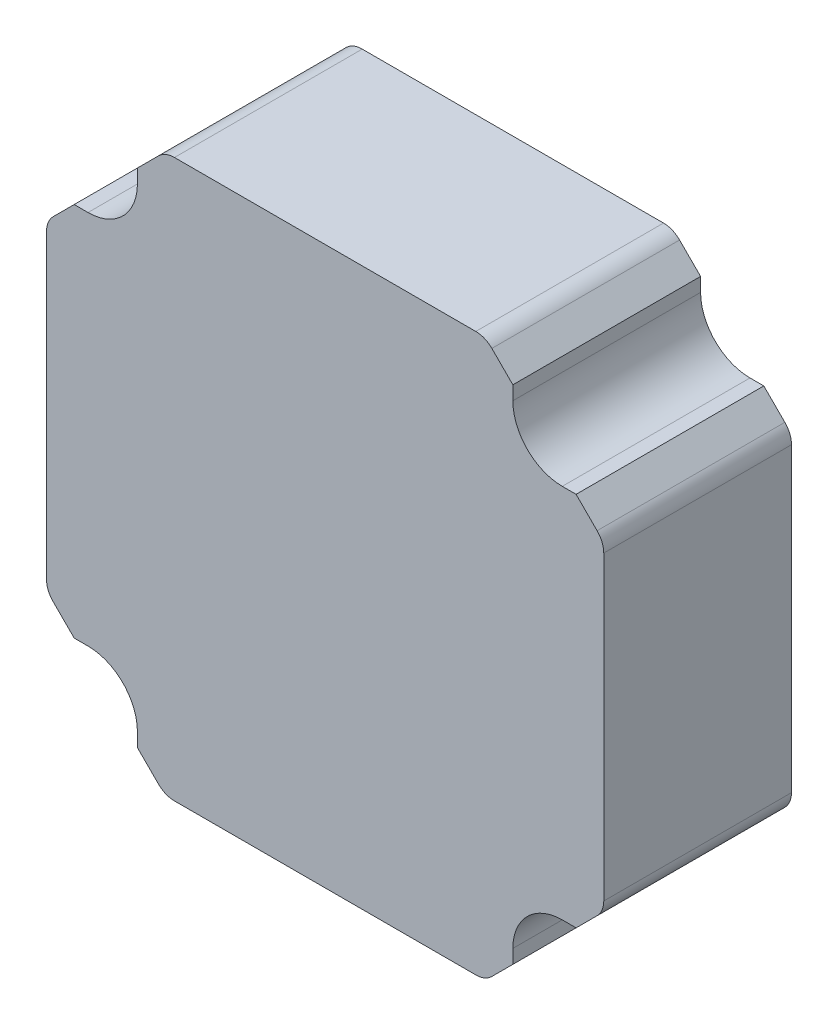
ISO-10303-21;
HEADER;
FILE_DESCRIPTION(('STEP AP214'),'2;1');
FILE_NAME('part.step','',(''),(''),'','','');
FILE_SCHEMA(('AUTOMOTIVE_DESIGN { 1 0 10303 214 1 1 1 1 }'));
ENDSEC;
DATA;
#1=APPLICATION_CONTEXT('core data for automotive mechanical design processes');
#2=APPLICATION_PROTOCOL_DEFINITION('international standard','automotive_design',2000,#1);
#3=PRODUCT_CONTEXT('',#1,'mechanical');
#4=PRODUCT('Part','Part','',(#3));
#5=PRODUCT_RELATED_PRODUCT_CATEGORY('part','',(#4));
#6=PRODUCT_DEFINITION_FORMATION('','',#4);
#7=PRODUCT_DEFINITION_CONTEXT('part definition',#1,'design');
#8=PRODUCT_DEFINITION('design','',#6,#7);
#9=PRODUCT_DEFINITION_SHAPE('','',#8);
#10=(LENGTH_UNIT() NAMED_UNIT(*) SI_UNIT(.MILLI.,.METRE.));
#11=(NAMED_UNIT(*) PLANE_ANGLE_UNIT() SI_UNIT($,.RADIAN.));
#12=(NAMED_UNIT(*) SI_UNIT($,.STERADIAN.) SOLID_ANGLE_UNIT());
#13=UNCERTAINTY_MEASURE_WITH_UNIT(LENGTH_MEASURE(1.E-05),#10,'distance_accuracy_value','');
#14=(GEOMETRIC_REPRESENTATION_CONTEXT(3) GLOBAL_UNCERTAINTY_ASSIGNED_CONTEXT((#13)) GLOBAL_UNIT_ASSIGNED_CONTEXT((#10,
#11,#12)) REPRESENTATION_CONTEXT('',''));
#15=CARTESIAN_POINT('',(0.,0.,0.));
#16=DIRECTION('',(0.,0.,1.));
#17=DIRECTION('',(1.,0.,0.));
#18=AXIS2_PLACEMENT_3D('',#15,#16,#17);
#19=CARTESIAN_POINT('',(24.,19.,19.));
#20=DIRECTION('',(0.,-1.,0.));
#21=DIRECTION('',(0.,0.,-1.));
#22=AXIS2_PLACEMENT_3D('',#19,#20,#21);
#23=PLANE('',#22);
#24=DIRECTION('',(0.,0.,-1.));
#25=VECTOR('',#24,1.);
#26=CARTESIAN_POINT('',(24.,19.,19.));
#27=LINE('',#26,#25);
#28=CARTESIAN_POINT('',(24.,19.,0.));
#29=VERTEX_POINT('',#28);
#30=CARTESIAN_POINT('',(24.,19.,19.));
#31=VERTEX_POINT('',#30);
#32=EDGE_CURVE('E433',#29,#31,#27,.F.);
#33=ORIENTED_EDGE('',*,*,#32,.T.);
#34=DIRECTION('',(1.,0.,0.));
#35=VECTOR('',#34,1.);
#36=CARTESIAN_POINT('',(0.,19.,19.));
#37=LINE('',#36,#35);
#38=CARTESIAN_POINT('',(25.4000000000001,19.,19.));
#39=VERTEX_POINT('',#38);
#40=EDGE_CURVE('E264',#39,#31,#37,.F.);
#41=ORIENTED_EDGE('',*,*,#40,.F.);
#42=DIRECTION('',(0.,0.,1.));
#43=VECTOR('',#42,1.);
#44=CARTESIAN_POINT('',(25.4000000000001,19.,19.));
#45=LINE('',#44,#43);
#46=CARTESIAN_POINT('',(25.4000000000001,19.,0.));
#47=VERTEX_POINT('',#46);
#48=EDGE_CURVE('E224',#39,#47,#45,.F.);
#49=ORIENTED_EDGE('',*,*,#48,.T.);
#50=DIRECTION('',(1.,0.,0.));
#51=VECTOR('',#50,1.);
#52=CARTESIAN_POINT('',(24.,19.,0.));
#53=LINE('',#52,#51);
#54=EDGE_CURVE('E355',#29,#47,#53,.T.);
#55=ORIENTED_EDGE('',*,*,#54,.F.);
#56=EDGE_LOOP('',(#33,#41,#49,#55));
#57=FACE_BOUND('',#56,.T.);
#58=ADVANCED_FACE('F17',(#57),#23,.F.);
#59=CARTESIAN_POINT('',(19.,25.4,19.));
#60=DIRECTION('',(-1.,0.,0.));
#61=DIRECTION('',(0.,0.,1.));
#62=AXIS2_PLACEMENT_3D('',#59,#60,#61);
#63=PLANE('',#62);
#64=DIRECTION('',(0.,0.,1.));
#65=VECTOR('',#64,1.);
#66=CARTESIAN_POINT('',(19.,25.4,19.));
#67=LINE('',#66,#65);
#68=CARTESIAN_POINT('',(19.,25.4,0.));
#69=VERTEX_POINT('',#68);
#70=CARTESIAN_POINT('',(19.,25.4,19.));
#71=VERTEX_POINT('',#70);
#72=EDGE_CURVE('E351',#69,#71,#67,.T.);
#73=ORIENTED_EDGE('',*,*,#72,.T.);
#74=DIRECTION('',(0.,1.,0.));
#75=VECTOR('',#74,1.);
#76=CARTESIAN_POINT('',(19.,0.,19.));
#77=LINE('',#76,#75);
#78=CARTESIAN_POINT('',(19.,24.,19.));
#79=VERTEX_POINT('',#78);
#80=EDGE_CURVE('E259',#79,#71,#77,.T.);
#81=ORIENTED_EDGE('',*,*,#80,.F.);
#82=DIRECTION('',(0.,0.,-1.));
#83=VECTOR('',#82,1.);
#84=CARTESIAN_POINT('',(19.,24.,19.));
#85=LINE('',#84,#83);
#86=CARTESIAN_POINT('',(19.,24.,0.));
#87=VERTEX_POINT('',#86);
#88=EDGE_CURVE('E432',#79,#87,#85,.T.);
#89=ORIENTED_EDGE('',*,*,#88,.T.);
#90=DIRECTION('',(0.,1.,0.));
#91=VECTOR('',#90,1.);
#92=CARTESIAN_POINT('',(19.,25.4,0.));
#93=LINE('',#92,#91);
#94=EDGE_CURVE('E333',#69,#87,#93,.F.);
#95=ORIENTED_EDGE('',*,*,#94,.F.);
#96=EDGE_LOOP('',(#73,#81,#89,#95));
#97=FACE_BOUND('',#96,.T.);
#98=ADVANCED_FACE('F517',(#97),#63,.F.);
#99=CARTESIAN_POINT('',(-19.,24.,19.));
#100=DIRECTION('',(1.,0.,0.));
#101=DIRECTION('',(0.,0.,-1.));
#102=AXIS2_PLACEMENT_3D('',#99,#100,#101);
#103=PLANE('',#102);
#104=DIRECTION('',(0.,0.,-1.));
#105=VECTOR('',#104,1.);
#106=CARTESIAN_POINT('',(-19.,24.,19.));
#107=LINE('',#106,#105);
#108=CARTESIAN_POINT('',(-19.,24.,0.));
#109=VERTEX_POINT('',#108);
#110=CARTESIAN_POINT('',(-19.,24.,19.));
#111=VERTEX_POINT('',#110);
#112=EDGE_CURVE('E427',#109,#111,#107,.F.);
#113=ORIENTED_EDGE('',*,*,#112,.T.);
#114=DIRECTION('',(0.,1.,0.));
#115=VECTOR('',#114,1.);
#116=CARTESIAN_POINT('',(-19.,0.,19.));
#117=LINE('',#116,#115);
#118=CARTESIAN_POINT('',(-19.,25.4000000000001,19.));
#119=VERTEX_POINT('',#118);
#120=EDGE_CURVE('E255',#119,#111,#117,.F.);
#121=ORIENTED_EDGE('',*,*,#120,.F.);
#122=DIRECTION('',(0.,0.,1.));
#123=VECTOR('',#122,1.);
#124=CARTESIAN_POINT('',(-19.,25.4000000000001,19.));
#125=LINE('',#124,#123);
#126=CARTESIAN_POINT('',(-19.,25.4000000000001,0.));
#127=VERTEX_POINT('',#126);
#128=EDGE_CURVE('E339',#119,#127,#125,.F.);
#129=ORIENTED_EDGE('',*,*,#128,.T.);
#130=DIRECTION('',(0.,1.,0.));
#131=VECTOR('',#130,1.);
#132=CARTESIAN_POINT('',(-19.,24.,0.));
#133=LINE('',#132,#131);
#134=EDGE_CURVE('E328',#109,#127,#133,.T.);
#135=ORIENTED_EDGE('',*,*,#134,.F.);
#136=EDGE_LOOP('',(#113,#121,#129,#135));
#137=FACE_BOUND('',#136,.T.);
#138=ADVANCED_FACE('F624',(#137),#103,.F.);
#139=CARTESIAN_POINT('',(-25.4,19.,19.));
#140=DIRECTION('',(0.,-1.,0.));
#141=DIRECTION('',(0.,0.,-1.));
#142=AXIS2_PLACEMENT_3D('',#139,#140,#141);
#143=PLANE('',#142);
#144=DIRECTION('',(0.,0.,1.));
#145=VECTOR('',#144,1.);
#146=CARTESIAN_POINT('',(-25.4,19.,19.));
#147=LINE('',#146,#145);
#148=CARTESIAN_POINT('',(-25.4,19.,0.));
#149=VERTEX_POINT('',#148);
#150=CARTESIAN_POINT('',(-25.4,19.,19.));
#151=VERTEX_POINT('',#150);
#152=EDGE_CURVE('E324',#149,#151,#147,.T.);
#153=ORIENTED_EDGE('',*,*,#152,.T.);
#154=DIRECTION('',(1.,0.,0.));
#155=VECTOR('',#154,1.);
#156=CARTESIAN_POINT('',(0.,19.,19.));
#157=LINE('',#156,#155);
#158=CARTESIAN_POINT('',(-24.,19.,19.));
#159=VERTEX_POINT('',#158);
#160=EDGE_CURVE('E250',#159,#151,#157,.F.);
#161=ORIENTED_EDGE('',*,*,#160,.F.);
#162=DIRECTION('',(0.,0.,-1.));
#163=VECTOR('',#162,1.);
#164=CARTESIAN_POINT('',(-24.,19.,19.));
#165=LINE('',#164,#163);
#166=CARTESIAN_POINT('',(-24.,19.,0.));
#167=VERTEX_POINT('',#166);
#168=EDGE_CURVE('E426',#159,#167,#165,.T.);
#169=ORIENTED_EDGE('',*,*,#168,.T.);
#170=DIRECTION('',(1.,0.,0.));
#171=VECTOR('',#170,1.);
#172=CARTESIAN_POINT('',(-25.4,19.,0.));
#173=LINE('',#172,#171);
#174=EDGE_CURVE('E305',#149,#167,#173,.T.);
#175=ORIENTED_EDGE('',*,*,#174,.F.);
#176=EDGE_LOOP('',(#153,#161,#169,#175));
#177=FACE_BOUND('',#176,.T.);
#178=ADVANCED_FACE('F643',(#177),#143,.F.);
#179=CARTESIAN_POINT('',(-24.,-19.,19.));
#180=DIRECTION('',(0.,1.,0.));
#181=DIRECTION('',(0.,0.,1.));
#182=AXIS2_PLACEMENT_3D('',#179,#180,#181);
#183=PLANE('',#182);
#184=DIRECTION('',(0.,0.,-1.));
#185=VECTOR('',#184,1.);
#186=CARTESIAN_POINT('',(-24.,-19.,19.));
#187=LINE('',#186,#185);
#188=CARTESIAN_POINT('',(-24.,-19.,0.));
#189=VERTEX_POINT('',#188);
#190=CARTESIAN_POINT('',(-24.,-19.,19.));
#191=VERTEX_POINT('',#190);
#192=EDGE_CURVE('E419',#189,#191,#187,.F.);
#193=ORIENTED_EDGE('',*,*,#192,.T.);
#194=DIRECTION('',(1.,0.,0.));
#195=VECTOR('',#194,1.);
#196=CARTESIAN_POINT('',(0.,-19.,19.));
#197=LINE('',#196,#195);
#198=CARTESIAN_POINT('',(-25.4000000000001,-19.,19.));
#199=VERTEX_POINT('',#198);
#200=EDGE_CURVE('E246',#199,#191,#197,.T.);
#201=ORIENTED_EDGE('',*,*,#200,.F.);
#202=DIRECTION('',(0.,0.,1.));
#203=VECTOR('',#202,1.);
#204=CARTESIAN_POINT('',(-25.4000000000001,-19.,19.));
#205=LINE('',#204,#203);
#206=CARTESIAN_POINT('',(-25.4000000000001,-19.,0.));
#207=VERTEX_POINT('',#206);
#208=EDGE_CURVE('E311',#199,#207,#205,.F.);
#209=ORIENTED_EDGE('',*,*,#208,.T.);
#210=DIRECTION('',(1.,0.,0.));
#211=VECTOR('',#210,1.);
#212=CARTESIAN_POINT('',(-24.,-19.,0.));
#213=LINE('',#212,#211);
#214=EDGE_CURVE('E300',#189,#207,#213,.F.);
#215=ORIENTED_EDGE('',*,*,#214,.F.);
#216=EDGE_LOOP('',(#193,#201,#209,#215));
#217=FACE_BOUND('',#216,.T.);
#218=ADVANCED_FACE('F670',(#217),#183,.F.);
#219=CARTESIAN_POINT('',(-19.,-25.4,19.));
#220=DIRECTION('',(1.,0.,0.));
#221=DIRECTION('',(0.,0.,-1.));
#222=AXIS2_PLACEMENT_3D('',#219,#220,#221);
#223=PLANE('',#222);
#224=DIRECTION('',(0.,0.,1.));
#225=VECTOR('',#224,1.);
#226=CARTESIAN_POINT('',(-19.,-25.4,19.));
#227=LINE('',#226,#225);
#228=CARTESIAN_POINT('',(-19.,-25.4,0.));
#229=VERTEX_POINT('',#228);
#230=CARTESIAN_POINT('',(-19.,-25.4,19.));
#231=VERTEX_POINT('',#230);
#232=EDGE_CURVE('E296',#229,#231,#227,.T.);
#233=ORIENTED_EDGE('',*,*,#232,.T.);
#234=DIRECTION('',(0.,1.,0.));
#235=VECTOR('',#234,1.);
#236=CARTESIAN_POINT('',(-19.,0.,19.));
#237=LINE('',#236,#235);
#238=CARTESIAN_POINT('',(-19.,-24.,19.));
#239=VERTEX_POINT('',#238);
#240=EDGE_CURVE('E241',#239,#231,#237,.F.);
#241=ORIENTED_EDGE('',*,*,#240,.F.);
#242=DIRECTION('',(0.,0.,-1.));
#243=VECTOR('',#242,1.);
#244=CARTESIAN_POINT('',(-19.,-24.,19.));
#245=LINE('',#244,#243);
#246=CARTESIAN_POINT('',(-19.,-24.,0.));
#247=VERTEX_POINT('',#246);
#248=EDGE_CURVE('E418',#239,#247,#245,.T.);
#249=ORIENTED_EDGE('',*,*,#248,.T.);
#250=DIRECTION('',(0.,1.,0.));
#251=VECTOR('',#250,1.);
#252=CARTESIAN_POINT('',(-19.,-25.4,0.));
#253=LINE('',#252,#251);
#254=EDGE_CURVE('E277',#229,#247,#253,.T.);
#255=ORIENTED_EDGE('',*,*,#254,.F.);
#256=EDGE_LOOP('',(#233,#241,#249,#255));
#257=FACE_BOUND('',#256,.T.);
#258=ADVANCED_FACE('F605',(#257),#223,.F.);
#259=CARTESIAN_POINT('',(19.,-24.,19.));
#260=DIRECTION('',(-1.,0.,0.));
#261=DIRECTION('',(0.,0.,1.));
#262=AXIS2_PLACEMENT_3D('',#259,#260,#261);
#263=PLANE('',#262);
#264=DIRECTION('',(0.,0.,-1.));
#265=VECTOR('',#264,1.);
#266=CARTESIAN_POINT('',(19.,-24.,19.));
#267=LINE('',#266,#265);
#268=CARTESIAN_POINT('',(19.,-24.,0.));
#269=VERTEX_POINT('',#268);
#270=CARTESIAN_POINT('',(19.,-24.,19.));
#271=VERTEX_POINT('',#270);
#272=EDGE_CURVE('E411',#269,#271,#267,.F.);
#273=ORIENTED_EDGE('',*,*,#272,.T.);
#274=DIRECTION('',(0.,1.,0.));
#275=VECTOR('',#274,1.);
#276=CARTESIAN_POINT('',(19.,0.,19.));
#277=LINE('',#276,#275);
#278=CARTESIAN_POINT('',(19.,-25.4000000000001,19.));
#279=VERTEX_POINT('',#278);
#280=EDGE_CURVE('E237',#279,#271,#277,.T.);
#281=ORIENTED_EDGE('',*,*,#280,.F.);
#282=DIRECTION('',(0.,0.,1.));
#283=VECTOR('',#282,1.);
#284=CARTESIAN_POINT('',(19.,-25.4000000000001,19.));
#285=LINE('',#284,#283);
#286=CARTESIAN_POINT('',(19.,-25.4000000000001,0.));
#287=VERTEX_POINT('',#286);
#288=EDGE_CURVE('E283',#279,#287,#285,.F.);
#289=ORIENTED_EDGE('',*,*,#288,.T.);
#290=DIRECTION('',(0.,1.,0.));
#291=VECTOR('',#290,1.);
#292=CARTESIAN_POINT('',(19.,-24.,0.));
#293=LINE('',#292,#291);
#294=EDGE_CURVE('E272',#269,#287,#293,.F.);
#295=ORIENTED_EDGE('',*,*,#294,.F.);
#296=EDGE_LOOP('',(#273,#281,#289,#295));
#297=FACE_BOUND('',#296,.T.);
#298=ADVANCED_FACE('F581',(#297),#263,.F.);
#299=CARTESIAN_POINT('',(25.4,-19.,19.));
#300=DIRECTION('',(0.,1.,0.));
#301=DIRECTION('',(0.,0.,1.));
#302=AXIS2_PLACEMENT_3D('',#299,#300,#301);
#303=PLANE('',#302);
#304=DIRECTION('',(0.,0.,1.));
#305=VECTOR('',#304,1.);
#306=CARTESIAN_POINT('',(25.4,-19.,19.));
#307=LINE('',#306,#305);
#308=CARTESIAN_POINT('',(25.4,-19.,0.));
#309=VERTEX_POINT('',#308);
#310=CARTESIAN_POINT('',(25.4,-19.,19.));
#311=VERTEX_POINT('',#310);
#312=EDGE_CURVE('E233',#309,#311,#307,.T.);
#313=ORIENTED_EDGE('',*,*,#312,.T.);
#314=DIRECTION('',(1.,0.,0.));
#315=VECTOR('',#314,1.);
#316=CARTESIAN_POINT('',(0.,-19.,19.));
#317=LINE('',#316,#315);
#318=CARTESIAN_POINT('',(24.,-19.,19.));
#319=VERTEX_POINT('',#318);
#320=EDGE_CURVE('E218',#319,#311,#317,.T.);
#321=ORIENTED_EDGE('',*,*,#320,.F.);
#322=DIRECTION('',(0.,0.,-1.));
#323=VECTOR('',#322,1.);
#324=CARTESIAN_POINT('',(24.,-19.,19.));
#325=LINE('',#324,#323);
#326=CARTESIAN_POINT('',(24.,-19.,0.));
#327=VERTEX_POINT('',#326);
#328=EDGE_CURVE('E410',#319,#327,#325,.T.);
#329=ORIENTED_EDGE('',*,*,#328,.T.);
#330=DIRECTION('',(1.,0.,0.));
#331=VECTOR('',#330,1.);
#332=CARTESIAN_POINT('',(25.4,-19.,0.));
#333=LINE('',#332,#331);
#334=EDGE_CURVE('E268',#309,#327,#333,.F.);
#335=ORIENTED_EDGE('',*,*,#334,.F.);
#336=EDGE_LOOP('',(#313,#321,#329,#335));
#337=FACE_BOUND('',#336,.T.);
#338=ADVANCED_FACE('F569',(#337),#303,.F.);
#339=CARTESIAN_POINT('',(0.,0.,19.));
#340=DIRECTION('',(0.,0.,1.));
#341=DIRECTION('',(1.,0.,0.));
#342=AXIS2_PLACEMENT_3D('',#339,#340,#341);
#343=PLANE('',#342);
#344=ORIENTED_EDGE('',*,*,#320,.T.);
#345=DIRECTION('',(-0.707106781186551,-0.707106781186544,0.));
#346=VECTOR('',#345,1.);
#347=CARTESIAN_POINT('',(28.2,-16.2,19.));
#348=LINE('',#347,#346);
#349=CARTESIAN_POINT('',(27.5263455967291,-16.8736544032709,19.));
#350=VERTEX_POINT('',#349);
#351=EDGE_CURVE('E230',#311,#350,#348,.F.);
#352=ORIENTED_EDGE('',*,*,#351,.T.);
#353=CARTESIAN_POINT('',(25.9,-15.2473088065419,19.));
#354=DIRECTION('',(0.,0.,-1.));
#355=DIRECTION('',(-1.,0.,0.));
#356=AXIS2_PLACEMENT_3D('',#353,#354,#355);
#357=CIRCLE('',#356,2.3);
#358=CARTESIAN_POINT('',(28.2,-15.2473088065419,19.));
#359=VERTEX_POINT('',#358);
#360=EDGE_CURVE('E214',#359,#350,#357,.T.);
#361=ORIENTED_EDGE('',*,*,#360,.F.);
#362=DIRECTION('',(0.,1.,0.));
#363=VECTOR('',#362,1.);
#364=CARTESIAN_POINT('',(28.2,28.2,19.));
#365=LINE('',#364,#363);
#366=CARTESIAN_POINT('',(28.2,15.2473088065419,19.));
#367=VERTEX_POINT('',#366);
#368=EDGE_CURVE('E209',#367,#359,#365,.F.);
#369=ORIENTED_EDGE('',*,*,#368,.F.);
#370=CARTESIAN_POINT('',(25.9,15.2473088065419,19.));
#371=DIRECTION('',(0.,0.,1.));
#372=DIRECTION('',(1.,0.,0.));
#373=AXIS2_PLACEMENT_3D('',#370,#371,#372);
#374=CIRCLE('',#373,2.3);
#375=CARTESIAN_POINT('',(27.5263455967291,16.8736544032709,19.));
#376=VERTEX_POINT('',#375);
#377=EDGE_CURVE('E20',#376,#367,#374,.F.);
#378=ORIENTED_EDGE('',*,*,#377,.F.);
#379=DIRECTION('',(0.707106781186544,-0.707106781186551,0.));
#380=VECTOR('',#379,1.);
#381=CARTESIAN_POINT('',(25.4000000000001,19.,19.));
#382=LINE('',#381,#380);
#383=EDGE_CURVE('E194',#376,#39,#382,.F.);
#384=ORIENTED_EDGE('',*,*,#383,.T.);
#385=ORIENTED_EDGE('',*,*,#40,.T.);
#386=CARTESIAN_POINT('',(24.,24.,19.));
#387=DIRECTION('',(0.,0.,-1.));
#388=DIRECTION('',(-1.,0.,0.));
#389=AXIS2_PLACEMENT_3D('',#386,#387,#388);
#390=CIRCLE('',#389,5.);
#391=EDGE_CURVE('E430',#31,#79,#390,.T.);
#392=ORIENTED_EDGE('',*,*,#391,.T.);
#393=ORIENTED_EDGE('',*,*,#80,.T.);
#394=DIRECTION('',(0.707106781186544,-0.707106781186551,0.));
#395=VECTOR('',#394,1.);
#396=CARTESIAN_POINT('',(16.2,28.2,19.));
#397=LINE('',#396,#395);
#398=CARTESIAN_POINT('',(16.8736544032709,27.5263455967291,19.));
#399=VERTEX_POINT('',#398);
#400=EDGE_CURVE('E347',#71,#399,#397,.F.);
#401=ORIENTED_EDGE('',*,*,#400,.T.);
#402=CARTESIAN_POINT('',(15.2473088065419,25.9,19.));
#403=DIRECTION('',(0.,0.,-1.));
#404=DIRECTION('',(-1.,0.,0.));
#405=AXIS2_PLACEMENT_3D('',#402,#403,#404);
#406=CIRCLE('',#405,2.3);
#407=CARTESIAN_POINT('',(15.2473088065419,28.2,19.));
#408=VERTEX_POINT('',#407);
#409=EDGE_CURVE('E350',#408,#399,#406,.T.);
#410=ORIENTED_EDGE('',*,*,#409,.F.);
#411=DIRECTION('',(1.,0.,0.));
#412=VECTOR('',#411,1.);
#413=CARTESIAN_POINT('',(-28.2,28.2,19.));
#414=LINE('',#413,#412);
#415=CARTESIAN_POINT('',(-15.2473088065419,28.2,19.));
#416=VERTEX_POINT('',#415);
#417=EDGE_CURVE('E343',#416,#408,#414,.T.);
#418=ORIENTED_EDGE('',*,*,#417,.F.);
#419=CARTESIAN_POINT('',(-15.2473088065419,25.9,19.));
#420=DIRECTION('',(0.,0.,1.));
#421=DIRECTION('',(1.,0.,0.));
#422=AXIS2_PLACEMENT_3D('',#419,#420,#421);
#423=CIRCLE('',#422,2.3);
#424=CARTESIAN_POINT('',(-16.8736544032709,27.5263455967291,19.));
#425=VERTEX_POINT('',#424);
#426=EDGE_CURVE('E428',#425,#416,#423,.F.);
#427=ORIENTED_EDGE('',*,*,#426,.F.);
#428=DIRECTION('',(0.707106781186551,0.707106781186544,0.));
#429=VECTOR('',#428,1.);
#430=CARTESIAN_POINT('',(-19.,25.4000000000001,19.));
#431=LINE('',#430,#429);
#432=EDGE_CURVE('E336',#425,#119,#431,.F.);
#433=ORIENTED_EDGE('',*,*,#432,.T.);
#434=ORIENTED_EDGE('',*,*,#120,.T.);
#435=CARTESIAN_POINT('',(-24.,24.,19.));
#436=DIRECTION('',(0.,0.,-1.));
#437=DIRECTION('',(-1.,0.,0.));
#438=AXIS2_PLACEMENT_3D('',#435,#436,#437);
#439=CIRCLE('',#438,5.);
#440=EDGE_CURVE('E423',#111,#159,#439,.T.);
#441=ORIENTED_EDGE('',*,*,#440,.T.);
#442=ORIENTED_EDGE('',*,*,#160,.T.);
#443=DIRECTION('',(0.707106781186551,0.707106781186544,0.));
#444=VECTOR('',#443,1.);
#445=CARTESIAN_POINT('',(-28.2,16.2,19.));
#446=LINE('',#445,#444);
#447=CARTESIAN_POINT('',(-27.5263455967291,16.8736544032709,19.));
#448=VERTEX_POINT('',#447);
#449=EDGE_CURVE('E320',#151,#448,#446,.F.);
#450=ORIENTED_EDGE('',*,*,#449,.T.);
#451=CARTESIAN_POINT('',(-25.9,15.2473088065419,19.));
#452=DIRECTION('',(0.,0.,-1.));
#453=DIRECTION('',(-1.,0.,0.));
#454=AXIS2_PLACEMENT_3D('',#451,#452,#453);
#455=CIRCLE('',#454,2.3);
#456=CARTESIAN_POINT('',(-28.2,15.2473088065419,19.));
#457=VERTEX_POINT('',#456);
#458=EDGE_CURVE('E323',#457,#448,#455,.T.);
#459=ORIENTED_EDGE('',*,*,#458,.F.);
#460=DIRECTION('',(0.,1.,0.));
#461=VECTOR('',#460,1.);
#462=CARTESIAN_POINT('',(-28.2,-28.2,19.));
#463=LINE('',#462,#461);
#464=CARTESIAN_POINT('',(-28.2,-15.2473088065419,19.));
#465=VERTEX_POINT('',#464);
#466=EDGE_CURVE('E315',#465,#457,#463,.T.);
#467=ORIENTED_EDGE('',*,*,#466,.F.);
#468=CARTESIAN_POINT('',(-25.9,-15.2473088065419,19.));
#469=DIRECTION('',(0.,0.,1.));
#470=DIRECTION('',(1.,0.,0.));
#471=AXIS2_PLACEMENT_3D('',#468,#469,#470);
#472=CIRCLE('',#471,2.3);
#473=CARTESIAN_POINT('',(-27.5263455967291,-16.8736544032709,19.));
#474=VERTEX_POINT('',#473);
#475=EDGE_CURVE('E318',#474,#465,#472,.F.);
#476=ORIENTED_EDGE('',*,*,#475,.F.);
#477=DIRECTION('',(-0.707106781186544,0.707106781186551,0.));
#478=VECTOR('',#477,1.);
#479=CARTESIAN_POINT('',(-25.4000000000001,-19.,19.));
#480=LINE('',#479,#478);
#481=EDGE_CURVE('E308',#474,#199,#480,.F.);
#482=ORIENTED_EDGE('',*,*,#481,.T.);
#483=ORIENTED_EDGE('',*,*,#200,.T.);
#484=CARTESIAN_POINT('',(-24.,-24.,19.));
#485=DIRECTION('',(0.,0.,-1.));
#486=DIRECTION('',(-1.,0.,0.));
#487=AXIS2_PLACEMENT_3D('',#484,#485,#486);
#488=CIRCLE('',#487,5.);
#489=EDGE_CURVE('E415',#191,#239,#488,.T.);
#490=ORIENTED_EDGE('',*,*,#489,.T.);
#491=ORIENTED_EDGE('',*,*,#240,.T.);
#492=DIRECTION('',(-0.707106781186544,0.707106781186551,0.));
#493=VECTOR('',#492,1.);
#494=CARTESIAN_POINT('',(-16.2,-28.2,19.));
#495=LINE('',#494,#493);
#496=CARTESIAN_POINT('',(-16.8736544032709,-27.5263455967291,19.));
#497=VERTEX_POINT('',#496);
#498=EDGE_CURVE('E292',#231,#497,#495,.F.);
#499=ORIENTED_EDGE('',*,*,#498,.T.);
#500=CARTESIAN_POINT('',(-15.2473088065419,-25.9,19.));
#501=DIRECTION('',(0.,0.,-1.));
#502=DIRECTION('',(-1.,0.,0.));
#503=AXIS2_PLACEMENT_3D('',#500,#501,#502);
#504=CIRCLE('',#503,2.3);
#505=CARTESIAN_POINT('',(-15.2473088065419,-28.2,19.));
#506=VERTEX_POINT('',#505);
#507=EDGE_CURVE('E295',#506,#497,#504,.T.);
#508=ORIENTED_EDGE('',*,*,#507,.F.);
#509=DIRECTION('',(1.,0.,0.));
#510=VECTOR('',#509,1.);
#511=CARTESIAN_POINT('',(28.2,-28.2,19.));
#512=LINE('',#511,#510);
#513=CARTESIAN_POINT('',(15.2473088065419,-28.2,19.));
#514=VERTEX_POINT('',#513);
#515=EDGE_CURVE('E287',#514,#506,#512,.F.);
#516=ORIENTED_EDGE('',*,*,#515,.F.);
#517=CARTESIAN_POINT('',(15.2473088065419,-25.9,19.));
#518=DIRECTION('',(0.,0.,1.));
#519=DIRECTION('',(1.,0.,0.));
#520=AXIS2_PLACEMENT_3D('',#517,#518,#519);
#521=CIRCLE('',#520,2.3);
#522=CARTESIAN_POINT('',(16.8736544032709,-27.5263455967291,19.));
#523=VERTEX_POINT('',#522);
#524=EDGE_CURVE('E290',#523,#514,#521,.F.);
#525=ORIENTED_EDGE('',*,*,#524,.F.);
#526=DIRECTION('',(-0.707106781186551,-0.707106781186544,0.));
#527=VECTOR('',#526,1.);
#528=CARTESIAN_POINT('',(19.,-25.4000000000001,19.));
#529=LINE('',#528,#527);
#530=EDGE_CURVE('E280',#523,#279,#529,.F.);
#531=ORIENTED_EDGE('',*,*,#530,.T.);
#532=ORIENTED_EDGE('',*,*,#280,.T.);
#533=CARTESIAN_POINT('',(24.,-24.,19.));
#534=DIRECTION('',(0.,0.,-1.));
#535=DIRECTION('',(-1.,0.,0.));
#536=AXIS2_PLACEMENT_3D('',#533,#534,#535);
#537=CIRCLE('',#536,5.);
#538=EDGE_CURVE('E407',#271,#319,#537,.T.);
#539=ORIENTED_EDGE('',*,*,#538,.T.);
#540=EDGE_LOOP('',(#344,#352,#361,#369,#378,#384,#385,#392,#393,#401,#410,#418,#427,#433,#434,
#441,#442,#450,#459,#467,#476,#482,#483,#490,#491,#499,#508,#516,#525,#531,#532,#539));
#541=FACE_BOUND('',#540,.T.);
#542=ADVANCED_FACE('F212',(#541),#343,.T.);
#543=CARTESIAN_POINT('',(28.2,28.2,0.));
#544=DIRECTION('',(1.,0.,0.));
#545=DIRECTION('',(0.,0.,-1.));
#546=AXIS2_PLACEMENT_3D('',#543,#544,#545);
#547=PLANE('',#546);
#548=DIRECTION('',(0.,0.,1.));
#549=VECTOR('',#548,1.);
#550=CARTESIAN_POINT('',(28.2,15.2473088065419,9.5));
#551=LINE('',#550,#549);
#552=CARTESIAN_POINT('',(28.2,15.2473088065419,0.));
#553=VERTEX_POINT('',#552);
#554=EDGE_CURVE('E205',#367,#553,#551,.F.);
#555=ORIENTED_EDGE('',*,*,#554,.F.);
#556=ORIENTED_EDGE('',*,*,#368,.T.);
#557=DIRECTION('',(0.,0.,-1.));
#558=VECTOR('',#557,1.);
#559=CARTESIAN_POINT('',(28.2,-15.2473088065419,9.5));
#560=LINE('',#559,#558);
#561=CARTESIAN_POINT('',(28.2,-15.2473088065419,0.));
#562=VERTEX_POINT('',#561);
#563=EDGE_CURVE('E232',#562,#359,#560,.F.);
#564=ORIENTED_EDGE('',*,*,#563,.F.);
#565=DIRECTION('',(0.,1.,0.));
#566=VECTOR('',#565,1.);
#567=CARTESIAN_POINT('',(28.2,0.,0.));
#568=LINE('',#567,#566);
#569=EDGE_CURVE('E222',#562,#553,#568,.T.);
#570=ORIENTED_EDGE('',*,*,#569,.T.);
#571=EDGE_LOOP('',(#555,#556,#564,#570));
#572=FACE_BOUND('',#571,.T.);
#573=ADVANCED_FACE('F221',(#572),#547,.T.);
#574=CARTESIAN_POINT('',(25.9,15.2473088065419,9.5));
#575=DIRECTION('',(0.,0.,1.));
#576=DIRECTION('',(1.,0.,0.));
#577=AXIS2_PLACEMENT_3D('',#574,#575,#576);
#578=CYLINDRICAL_SURFACE('',#577,2.3);
#579=CARTESIAN_POINT('',(25.9,15.2473088065419,0.));
#580=DIRECTION('',(0.,0.,1.));
#581=DIRECTION('',(1.,0.,0.));
#582=AXIS2_PLACEMENT_3D('',#579,#580,#581);
#583=CIRCLE('',#582,2.3);
#584=CARTESIAN_POINT('',(27.5263455967291,16.8736544032709,0.));
#585=VERTEX_POINT('',#584);
#586=EDGE_CURVE('E404',#553,#585,#583,.T.);
#587=ORIENTED_EDGE('',*,*,#586,.T.);
#588=DIRECTION('',(0.,0.,1.));
#589=VECTOR('',#588,1.);
#590=CARTESIAN_POINT('',(27.5263455967291,16.8736544032709,19.));
#591=LINE('',#590,#589);
#592=EDGE_CURVE('E207',#585,#376,#591,.T.);
#593=ORIENTED_EDGE('',*,*,#592,.T.);
#594=ORIENTED_EDGE('',*,*,#377,.T.);
#595=ORIENTED_EDGE('',*,*,#554,.T.);
#596=EDGE_LOOP('',(#587,#593,#594,#595));
#597=FACE_BOUND('',#596,.T.);
#598=ADVANCED_FACE('F203',(#597),#578,.T.);
#599=CARTESIAN_POINT('',(25.4000000000001,19.,19.));
#600=DIRECTION('',(-0.707106781186551,-0.707106781186544,0.));
#601=DIRECTION('',(0.707106781186544,-0.707106781186551,0.));
#602=AXIS2_PLACEMENT_3D('',#599,#600,#601);
#603=PLANE('',#602);
#604=DIRECTION('',(-0.707106781186543,0.707106781186552,0.));
#605=VECTOR('',#604,1.);
#606=CARTESIAN_POINT('',(27.5263455967291,16.8736544032709,0.));
#607=LINE('',#606,#605);
#608=EDGE_CURVE('E403',#585,#47,#607,.T.);
#609=ORIENTED_EDGE('',*,*,#608,.T.);
#610=ORIENTED_EDGE('',*,*,#48,.F.);
#611=ORIENTED_EDGE('',*,*,#383,.F.);
#612=ORIENTED_EDGE('',*,*,#592,.F.);
#613=EDGE_LOOP('',(#609,#610,#611,#612));
#614=FACE_BOUND('',#613,.T.);
#615=ADVANCED_FACE('F446',(#614),#603,.F.);
#616=CARTESIAN_POINT('',(24.,24.,19.));
#617=DIRECTION('',(0.,0.,-1.));
#618=DIRECTION('',(-1.,0.,0.));
#619=AXIS2_PLACEMENT_3D('',#616,#617,#618);
#620=CYLINDRICAL_SURFACE('',#619,5.);
#621=ORIENTED_EDGE('',*,*,#88,.F.);
#622=ORIENTED_EDGE('',*,*,#391,.F.);
#623=ORIENTED_EDGE('',*,*,#32,.F.);
#624=CARTESIAN_POINT('',(24.,24.,0.));
#625=DIRECTION('',(0.,0.,-1.));
#626=DIRECTION('',(-1.,0.,0.));
#627=AXIS2_PLACEMENT_3D('',#624,#625,#626);
#628=CIRCLE('',#627,5.);
#629=EDGE_CURVE('E400',#29,#87,#628,.T.);
#630=ORIENTED_EDGE('',*,*,#629,.T.);
#631=EDGE_LOOP('',(#621,#622,#623,#630));
#632=FACE_BOUND('',#631,.T.);
#633=ADVANCED_FACE('F838',(#632),#620,.F.);
#634=CARTESIAN_POINT('',(16.2,28.2,19.));
#635=DIRECTION('',(-0.707106781186551,-0.707106781186544,0.));
#636=DIRECTION('',(0.707106781186544,-0.707106781186551,0.));
#637=AXIS2_PLACEMENT_3D('',#634,#635,#636);
#638=PLANE('',#637);
#639=ORIENTED_EDGE('',*,*,#400,.F.);
#640=ORIENTED_EDGE('',*,*,#72,.F.);
#641=DIRECTION('',(-0.707106781186542,0.707106781186553,0.));
#642=VECTOR('',#641,1.);
#643=CARTESIAN_POINT('',(19.,25.4,0.));
#644=LINE('',#643,#642);
#645=CARTESIAN_POINT('',(16.8736544032709,27.5263455967291,0.));
#646=VERTEX_POINT('',#645);
#647=EDGE_CURVE('E399',#69,#646,#644,.T.);
#648=ORIENTED_EDGE('',*,*,#647,.T.);
#649=DIRECTION('',(0.,0.,-1.));
#650=VECTOR('',#649,1.);
#651=CARTESIAN_POINT('',(16.8736544032709,27.5263455967291,9.5));
#652=LINE('',#651,#650);
#653=EDGE_CURVE('E346',#399,#646,#652,.T.);
#654=ORIENTED_EDGE('',*,*,#653,.F.);
#655=EDGE_LOOP('',(#639,#640,#648,#654));
#656=FACE_BOUND('',#655,.T.);
#657=ADVANCED_FACE('F524',(#656),#638,.F.);
#658=CARTESIAN_POINT('',(15.2473088065419,25.9,9.5));
#659=DIRECTION('',(0.,0.,-1.));
#660=DIRECTION('',(-1.,0.,0.));
#661=AXIS2_PLACEMENT_3D('',#658,#659,#660);
#662=CYLINDRICAL_SURFACE('',#661,2.3);
#663=ORIENTED_EDGE('',*,*,#409,.T.);
#664=ORIENTED_EDGE('',*,*,#653,.T.);
#665=CARTESIAN_POINT('',(15.2473088065419,25.9,0.));
#666=DIRECTION('',(0.,0.,-1.));
#667=DIRECTION('',(-1.,0.,0.));
#668=AXIS2_PLACEMENT_3D('',#665,#666,#667);
#669=CIRCLE('',#668,2.3);
#670=CARTESIAN_POINT('',(15.2473088065419,28.2,0.));
#671=VERTEX_POINT('',#670);
#672=EDGE_CURVE('E396',#646,#671,#669,.F.);
#673=ORIENTED_EDGE('',*,*,#672,.T.);
#674=DIRECTION('',(0.,0.,1.));
#675=VECTOR('',#674,1.);
#676=CARTESIAN_POINT('',(15.2473088065419,28.2,0.));
#677=LINE('',#676,#675);
#678=EDGE_CURVE('E345',#408,#671,#677,.F.);
#679=ORIENTED_EDGE('',*,*,#678,.F.);
#680=EDGE_LOOP('',(#663,#664,#673,#679));
#681=FACE_BOUND('',#680,.T.);
#682=ADVANCED_FACE('F637',(#681),#662,.T.);
#683=CARTESIAN_POINT('',(-28.2,28.2,0.));
#684=DIRECTION('',(0.,1.,0.));
#685=DIRECTION('',(0.,0.,1.));
#686=AXIS2_PLACEMENT_3D('',#683,#684,#685);
#687=PLANE('',#686);
#688=ORIENTED_EDGE('',*,*,#678,.T.);
#689=DIRECTION('',(1.,0.,0.));
#690=VECTOR('',#689,1.);
#691=CARTESIAN_POINT('',(0.,28.2,0.));
#692=LINE('',#691,#690);
#693=CARTESIAN_POINT('',(-15.2473088065419,28.2,0.));
#694=VERTEX_POINT('',#693);
#695=EDGE_CURVE('E395',#671,#694,#692,.F.);
#696=ORIENTED_EDGE('',*,*,#695,.T.);
#697=DIRECTION('',(0.,0.,1.));
#698=VECTOR('',#697,1.);
#699=CARTESIAN_POINT('',(-15.2473088065419,28.2,9.5));
#700=LINE('',#699,#698);
#701=EDGE_CURVE('E340',#416,#694,#700,.F.);
#702=ORIENTED_EDGE('',*,*,#701,.F.);
#703=ORIENTED_EDGE('',*,*,#417,.T.);
#704=EDGE_LOOP('',(#688,#696,#702,#703));
#705=FACE_BOUND('',#704,.T.);
#706=ADVANCED_FACE('F633',(#705),#687,.T.);
#707=CARTESIAN_POINT('',(-15.2473088065419,25.9,9.5));
#708=DIRECTION('',(0.,0.,1.));
#709=DIRECTION('',(1.,0.,0.));
#710=AXIS2_PLACEMENT_3D('',#707,#708,#709);
#711=CYLINDRICAL_SURFACE('',#710,2.3);
#712=CARTESIAN_POINT('',(-15.2473088065419,25.9,0.));
#713=DIRECTION('',(0.,0.,1.));
#714=DIRECTION('',(1.,0.,0.));
#715=AXIS2_PLACEMENT_3D('',#712,#713,#714);
#716=CIRCLE('',#715,2.3);
#717=CARTESIAN_POINT('',(-16.8736544032709,27.5263455967291,0.));
#718=VERTEX_POINT('',#717);
#719=EDGE_CURVE('E392',#694,#718,#716,.T.);
#720=ORIENTED_EDGE('',*,*,#719,.T.);
#721=DIRECTION('',(0.,0.,1.));
#722=VECTOR('',#721,1.);
#723=CARTESIAN_POINT('',(-16.8736544032709,27.5263455967291,19.));
#724=LINE('',#723,#722);
#725=EDGE_CURVE('E502',#718,#425,#724,.T.);
#726=ORIENTED_EDGE('',*,*,#725,.T.);
#727=ORIENTED_EDGE('',*,*,#426,.T.);
#728=ORIENTED_EDGE('',*,*,#701,.T.);
#729=EDGE_LOOP('',(#720,#726,#727,#728));
#730=FACE_BOUND('',#729,.T.);
#731=ADVANCED_FACE('F629',(#730),#711,.T.);
#732=CARTESIAN_POINT('',(-19.,25.4000000000001,19.));
#733=DIRECTION('',(0.707106781186544,-0.707106781186551,0.));
#734=DIRECTION('',(0.707106781186551,0.707106781186544,0.));
#735=AXIS2_PLACEMENT_3D('',#732,#733,#734);
#736=PLANE('',#735);
#737=DIRECTION('',(-0.707106781186549,-0.707106781186546,0.));
#738=VECTOR('',#737,1.);
#739=CARTESIAN_POINT('',(-16.8736544032709,27.5263455967291,0.));
#740=LINE('',#739,#738);
#741=EDGE_CURVE('E391',#718,#127,#740,.T.);
#742=ORIENTED_EDGE('',*,*,#741,.T.);
#743=ORIENTED_EDGE('',*,*,#128,.F.);
#744=ORIENTED_EDGE('',*,*,#432,.F.);
#745=ORIENTED_EDGE('',*,*,#725,.F.);
#746=EDGE_LOOP('',(#742,#743,#744,#745));
#747=FACE_BOUND('',#746,.T.);
#748=ADVANCED_FACE('F626',(#747),#736,.F.);
#749=CARTESIAN_POINT('',(-24.,24.,19.));
#750=DIRECTION('',(0.,0.,-1.));
#751=DIRECTION('',(-1.,0.,0.));
#752=AXIS2_PLACEMENT_3D('',#749,#750,#751);
#753=CYLINDRICAL_SURFACE('',#752,5.);
#754=ORIENTED_EDGE('',*,*,#168,.F.);
#755=ORIENTED_EDGE('',*,*,#440,.F.);
#756=ORIENTED_EDGE('',*,*,#112,.F.);
#757=CARTESIAN_POINT('',(-24.,24.,0.));
#758=DIRECTION('',(0.,0.,-1.));
#759=DIRECTION('',(-1.,0.,0.));
#760=AXIS2_PLACEMENT_3D('',#757,#758,#759);
#761=CIRCLE('',#760,5.);
#762=EDGE_CURVE('E388',#109,#167,#761,.T.);
#763=ORIENTED_EDGE('',*,*,#762,.T.);
#764=EDGE_LOOP('',(#754,#755,#756,#763));
#765=FACE_BOUND('',#764,.T.);
#766=ADVANCED_FACE('F641',(#765),#753,.F.);
#767=CARTESIAN_POINT('',(-28.2,16.2,19.));
#768=DIRECTION('',(0.707106781186544,-0.707106781186551,0.));
#769=DIRECTION('',(0.707106781186551,0.707106781186544,0.));
#770=AXIS2_PLACEMENT_3D('',#767,#768,#769);
#771=PLANE('',#770);
#772=ORIENTED_EDGE('',*,*,#449,.F.);
#773=ORIENTED_EDGE('',*,*,#152,.F.);
#774=DIRECTION('',(-0.707106781186552,-0.707106781186543,0.));
#775=VECTOR('',#774,1.);
#776=CARTESIAN_POINT('',(-25.4,19.,0.));
#777=LINE('',#776,#775);
#778=CARTESIAN_POINT('',(-27.5263455967291,16.8736544032709,0.));
#779=VERTEX_POINT('',#778);
#780=EDGE_CURVE('E387',#149,#779,#777,.T.);
#781=ORIENTED_EDGE('',*,*,#780,.T.);
#782=DIRECTION('',(0.,0.,-1.));
#783=VECTOR('',#782,1.);
#784=CARTESIAN_POINT('',(-27.5263455967291,16.8736544032709,9.5));
#785=LINE('',#784,#783);
#786=EDGE_CURVE('E422',#448,#779,#785,.T.);
#787=ORIENTED_EDGE('',*,*,#786,.F.);
#788=EDGE_LOOP('',(#772,#773,#781,#787));
#789=FACE_BOUND('',#788,.T.);
#790=ADVANCED_FACE('F648',(#789),#771,.F.);
#791=CARTESIAN_POINT('',(-25.9,15.2473088065419,9.5));
#792=DIRECTION('',(0.,0.,-1.));
#793=DIRECTION('',(-1.,0.,0.));
#794=AXIS2_PLACEMENT_3D('',#791,#792,#793);
#795=CYLINDRICAL_SURFACE('',#794,2.3);
#796=ORIENTED_EDGE('',*,*,#458,.T.);
#797=ORIENTED_EDGE('',*,*,#786,.T.);
#798=CARTESIAN_POINT('',(-25.9,15.2473088065419,0.));
#799=DIRECTION('',(0.,0.,-1.));
#800=DIRECTION('',(-1.,0.,0.));
#801=AXIS2_PLACEMENT_3D('',#798,#799,#800);
#802=CIRCLE('',#801,2.3);
#803=CARTESIAN_POINT('',(-28.2,15.2473088065419,0.));
#804=VERTEX_POINT('',#803);
#805=EDGE_CURVE('E384',#779,#804,#802,.F.);
#806=ORIENTED_EDGE('',*,*,#805,.T.);
#807=DIRECTION('',(0.,0.,1.));
#808=VECTOR('',#807,1.);
#809=CARTESIAN_POINT('',(-28.2,15.2473088065419,0.));
#810=LINE('',#809,#808);
#811=EDGE_CURVE('E319',#457,#804,#810,.F.);
#812=ORIENTED_EDGE('',*,*,#811,.F.);
#813=EDGE_LOOP('',(#796,#797,#806,#812));
#814=FACE_BOUND('',#813,.T.);
#815=ADVANCED_FACE('F652',(#814),#795,.T.);
#816=CARTESIAN_POINT('',(-28.2,-28.2,0.));
#817=DIRECTION('',(-1.,0.,0.));
#818=DIRECTION('',(0.,0.,1.));
#819=AXIS2_PLACEMENT_3D('',#816,#817,#818);
#820=PLANE('',#819);
#821=DIRECTION('',(0.,0.,1.));
#822=VECTOR('',#821,1.);
#823=CARTESIAN_POINT('',(-28.2,-15.2473088065419,9.5));
#824=LINE('',#823,#822);
#825=CARTESIAN_POINT('',(-28.2,-15.2473088065419,0.));
#826=VERTEX_POINT('',#825);
#827=EDGE_CURVE('E312',#465,#826,#824,.F.);
#828=ORIENTED_EDGE('',*,*,#827,.F.);
#829=ORIENTED_EDGE('',*,*,#466,.T.);
#830=ORIENTED_EDGE('',*,*,#811,.T.);
#831=DIRECTION('',(0.,1.,0.));
#832=VECTOR('',#831,1.);
#833=CARTESIAN_POINT('',(-28.2,0.,0.));
#834=LINE('',#833,#832);
#835=EDGE_CURVE('E383',#804,#826,#834,.F.);
#836=ORIENTED_EDGE('',*,*,#835,.T.);
#837=EDGE_LOOP('',(#828,#829,#830,#836));
#838=FACE_BOUND('',#837,.T.);
#839=ADVANCED_FACE('F659',(#838),#820,.T.);
#840=CARTESIAN_POINT('',(-25.9,-15.2473088065419,9.5));
#841=DIRECTION('',(0.,0.,1.));
#842=DIRECTION('',(1.,0.,0.));
#843=AXIS2_PLACEMENT_3D('',#840,#841,#842);
#844=CYLINDRICAL_SURFACE('',#843,2.3);
#845=CARTESIAN_POINT('',(-25.9,-15.2473088065419,0.));
#846=DIRECTION('',(0.,0.,1.));
#847=DIRECTION('',(1.,0.,0.));
#848=AXIS2_PLACEMENT_3D('',#845,#846,#847);
#849=CIRCLE('',#848,2.3);
#850=CARTESIAN_POINT('',(-27.5263455967291,-16.8736544032709,0.));
#851=VERTEX_POINT('',#850);
#852=EDGE_CURVE('E380',#826,#851,#849,.T.);
#853=ORIENTED_EDGE('',*,*,#852,.T.);
#854=DIRECTION('',(0.,0.,1.));
#855=VECTOR('',#854,1.);
#856=CARTESIAN_POINT('',(-27.5263455967291,-16.8736544032709,19.));
#857=LINE('',#856,#855);
#858=EDGE_CURVE('E484',#851,#474,#857,.T.);
#859=ORIENTED_EDGE('',*,*,#858,.T.);
#860=ORIENTED_EDGE('',*,*,#475,.T.);
#861=ORIENTED_EDGE('',*,*,#827,.T.);
#862=EDGE_LOOP('',(#853,#859,#860,#861));
#863=FACE_BOUND('',#862,.T.);
#864=ADVANCED_FACE('F663',(#863),#844,.T.);
#865=CARTESIAN_POINT('',(-25.4000000000001,-19.,19.));
#866=DIRECTION('',(0.707106781186551,0.707106781186544,0.));
#867=DIRECTION('',(-0.707106781186544,0.707106781186551,0.));
#868=AXIS2_PLACEMENT_3D('',#865,#866,#867);
#869=PLANE('',#868);
#870=DIRECTION('',(0.707106781186545,-0.70710678118655,0.));
#871=VECTOR('',#870,1.);
#872=CARTESIAN_POINT('',(-27.5263455967291,-16.8736544032709,0.));
#873=LINE('',#872,#871);
#874=EDGE_CURVE('E379',#851,#207,#873,.T.);
#875=ORIENTED_EDGE('',*,*,#874,.T.);
#876=ORIENTED_EDGE('',*,*,#208,.F.);
#877=ORIENTED_EDGE('',*,*,#481,.F.);
#878=ORIENTED_EDGE('',*,*,#858,.F.);
#879=EDGE_LOOP('',(#875,#876,#877,#878));
#880=FACE_BOUND('',#879,.T.);
#881=ADVANCED_FACE('F665',(#880),#869,.F.);
#882=CARTESIAN_POINT('',(-24.,-24.,19.));
#883=DIRECTION('',(0.,0.,-1.));
#884=DIRECTION('',(-1.,0.,0.));
#885=AXIS2_PLACEMENT_3D('',#882,#883,#884);
#886=CYLINDRICAL_SURFACE('',#885,5.);
#887=ORIENTED_EDGE('',*,*,#248,.F.);
#888=ORIENTED_EDGE('',*,*,#489,.F.);
#889=ORIENTED_EDGE('',*,*,#192,.F.);
#890=CARTESIAN_POINT('',(-24.,-24.,0.));
#891=DIRECTION('',(0.,0.,-1.));
#892=DIRECTION('',(-1.,0.,0.));
#893=AXIS2_PLACEMENT_3D('',#890,#891,#892);
#894=CIRCLE('',#893,5.);
#895=EDGE_CURVE('E376',#189,#247,#894,.T.);
#896=ORIENTED_EDGE('',*,*,#895,.T.);
#897=EDGE_LOOP('',(#887,#888,#889,#896));
#898=FACE_BOUND('',#897,.T.);
#899=ADVANCED_FACE('F673',(#898),#886,.F.);
#900=CARTESIAN_POINT('',(-16.2,-28.2,19.));
#901=DIRECTION('',(0.707106781186551,0.707106781186544,0.));
#902=DIRECTION('',(-0.707106781186544,0.707106781186551,0.));
#903=AXIS2_PLACEMENT_3D('',#900,#901,#902);
#904=PLANE('',#903);
#905=ORIENTED_EDGE('',*,*,#498,.F.);
#906=ORIENTED_EDGE('',*,*,#232,.F.);
#907=DIRECTION('',(0.707106781186543,-0.707106781186552,0.));
#908=VECTOR('',#907,1.);
#909=CARTESIAN_POINT('',(-19.,-25.4,0.));
#910=LINE('',#909,#908);
#911=CARTESIAN_POINT('',(-16.8736544032709,-27.5263455967291,0.));
#912=VERTEX_POINT('',#911);
#913=EDGE_CURVE('E375',#229,#912,#910,.T.);
#914=ORIENTED_EDGE('',*,*,#913,.T.);
#915=DIRECTION('',(0.,0.,-1.));
#916=VECTOR('',#915,1.);
#917=CARTESIAN_POINT('',(-16.8736544032709,-27.5263455967291,9.5));
#918=LINE('',#917,#916);
#919=EDGE_CURVE('E414',#497,#912,#918,.T.);
#920=ORIENTED_EDGE('',*,*,#919,.F.);
#921=EDGE_LOOP('',(#905,#906,#914,#920));
#922=FACE_BOUND('',#921,.T.);
#923=ADVANCED_FACE('F601',(#922),#904,.F.);
#924=CARTESIAN_POINT('',(-15.2473088065419,-25.9,9.5));
#925=DIRECTION('',(0.,0.,-1.));
#926=DIRECTION('',(-1.,0.,0.));
#927=AXIS2_PLACEMENT_3D('',#924,#925,#926);
#928=CYLINDRICAL_SURFACE('',#927,2.3);
#929=ORIENTED_EDGE('',*,*,#507,.T.);
#930=ORIENTED_EDGE('',*,*,#919,.T.);
#931=CARTESIAN_POINT('',(-15.2473088065419,-25.9,0.));
#932=DIRECTION('',(0.,0.,-1.));
#933=DIRECTION('',(-1.,0.,0.));
#934=AXIS2_PLACEMENT_3D('',#931,#932,#933);
#935=CIRCLE('',#934,2.3);
#936=CARTESIAN_POINT('',(-15.2473088065419,-28.2,0.));
#937=VERTEX_POINT('',#936);
#938=EDGE_CURVE('E372',#912,#937,#935,.F.);
#939=ORIENTED_EDGE('',*,*,#938,.T.);
#940=DIRECTION('',(0.,0.,-1.));
#941=VECTOR('',#940,1.);
#942=CARTESIAN_POINT('',(-15.2473088065419,-28.2,0.));
#943=LINE('',#942,#941);
#944=EDGE_CURVE('E291',#506,#937,#943,.T.);
#945=ORIENTED_EDGE('',*,*,#944,.F.);
#946=EDGE_LOOP('',(#929,#930,#939,#945));
#947=FACE_BOUND('',#946,.T.);
#948=ADVANCED_FACE('F595',(#947),#928,.T.);
#949=CARTESIAN_POINT('',(28.2,-28.2,0.));
#950=DIRECTION('',(0.,-1.,0.));
#951=DIRECTION('',(0.,0.,-1.));
#952=AXIS2_PLACEMENT_3D('',#949,#950,#951);
#953=PLANE('',#952);
#954=DIRECTION('',(0.,0.,1.));
#955=VECTOR('',#954,1.);
#956=CARTESIAN_POINT('',(15.2473088065419,-28.2,9.5));
#957=LINE('',#956,#955);
#958=CARTESIAN_POINT('',(15.2473088065419,-28.2,0.));
#959=VERTEX_POINT('',#958);
#960=EDGE_CURVE('E284',#514,#959,#957,.F.);
#961=ORIENTED_EDGE('',*,*,#960,.F.);
#962=ORIENTED_EDGE('',*,*,#515,.T.);
#963=ORIENTED_EDGE('',*,*,#944,.T.);
#964=DIRECTION('',(1.,0.,0.));
#965=VECTOR('',#964,1.);
#966=CARTESIAN_POINT('',(0.,-28.2,0.));
#967=LINE('',#966,#965);
#968=EDGE_CURVE('E371',#937,#959,#967,.T.);
#969=ORIENTED_EDGE('',*,*,#968,.T.);
#970=EDGE_LOOP('',(#961,#962,#963,#969));
#971=FACE_BOUND('',#970,.T.);
#972=ADVANCED_FACE('F592',(#971),#953,.T.);
#973=CARTESIAN_POINT('',(15.2473088065419,-25.9,9.5));
#974=DIRECTION('',(0.,0.,1.));
#975=DIRECTION('',(1.,0.,0.));
#976=AXIS2_PLACEMENT_3D('',#973,#974,#975);
#977=CYLINDRICAL_SURFACE('',#976,2.3);
#978=CARTESIAN_POINT('',(15.2473088065419,-25.9,0.));
#979=DIRECTION('',(0.,0.,1.));
#980=DIRECTION('',(1.,0.,0.));
#981=AXIS2_PLACEMENT_3D('',#978,#979,#980);
#982=CIRCLE('',#981,2.3);
#983=CARTESIAN_POINT('',(16.8736544032709,-27.5263455967291,0.));
#984=VERTEX_POINT('',#983);
#985=EDGE_CURVE('E368',#959,#984,#982,.T.);
#986=ORIENTED_EDGE('',*,*,#985,.T.);
#987=DIRECTION('',(0.,0.,1.));
#988=VECTOR('',#987,1.);
#989=CARTESIAN_POINT('',(16.8736544032709,-27.5263455967291,19.));
#990=LINE('',#989,#988);
#991=EDGE_CURVE('E466',#984,#523,#990,.T.);
#992=ORIENTED_EDGE('',*,*,#991,.T.);
#993=ORIENTED_EDGE('',*,*,#524,.T.);
#994=ORIENTED_EDGE('',*,*,#960,.T.);
#995=EDGE_LOOP('',(#986,#992,#993,#994));
#996=FACE_BOUND('',#995,.T.);
#997=ADVANCED_FACE('F586',(#996),#977,.T.);
#998=CARTESIAN_POINT('',(19.,-25.4000000000001,19.));
#999=DIRECTION('',(-0.707106781186544,0.707106781186551,0.));
#1000=DIRECTION('',(-0.707106781186551,-0.707106781186544,0.));
#1001=AXIS2_PLACEMENT_3D('',#998,#999,#1000);
#1002=PLANE('',#1001);
#1003=DIRECTION('',(0.707106781186551,0.707106781186544,0.));
#1004=VECTOR('',#1003,1.);
#1005=CARTESIAN_POINT('',(16.8736544032709,-27.5263455967291,0.));
#1006=LINE('',#1005,#1004);
#1007=EDGE_CURVE('E367',#984,#287,#1006,.T.);
#1008=ORIENTED_EDGE('',*,*,#1007,.T.);
#1009=ORIENTED_EDGE('',*,*,#288,.F.);
#1010=ORIENTED_EDGE('',*,*,#530,.F.);
#1011=ORIENTED_EDGE('',*,*,#991,.F.);
#1012=EDGE_LOOP('',(#1008,#1009,#1010,#1011));
#1013=FACE_BOUND('',#1012,.T.);
#1014=ADVANCED_FACE('F583',(#1013),#1002,.F.);
#1015=CARTESIAN_POINT('',(24.,-24.,19.));
#1016=DIRECTION('',(0.,0.,-1.));
#1017=DIRECTION('',(-1.,0.,0.));
#1018=AXIS2_PLACEMENT_3D('',#1015,#1016,#1017);
#1019=CYLINDRICAL_SURFACE('',#1018,5.);
#1020=ORIENTED_EDGE('',*,*,#328,.F.);
#1021=ORIENTED_EDGE('',*,*,#538,.F.);
#1022=ORIENTED_EDGE('',*,*,#272,.F.);
#1023=CARTESIAN_POINT('',(24.,-24.,0.));
#1024=DIRECTION('',(0.,0.,-1.));
#1025=DIRECTION('',(-1.,0.,0.));
#1026=AXIS2_PLACEMENT_3D('',#1023,#1024,#1025);
#1027=CIRCLE('',#1026,5.);
#1028=EDGE_CURVE('E364',#269,#327,#1027,.T.);
#1029=ORIENTED_EDGE('',*,*,#1028,.T.);
#1030=EDGE_LOOP('',(#1020,#1021,#1022,#1029));
#1031=FACE_BOUND('',#1030,.T.);
#1032=ADVANCED_FACE('F574',(#1031),#1019,.F.);
#1033=CARTESIAN_POINT('',(28.2,-16.2,19.));
#1034=DIRECTION('',(-0.707106781186544,0.707106781186551,0.));
#1035=DIRECTION('',(-0.707106781186551,-0.707106781186544,0.));
#1036=AXIS2_PLACEMENT_3D('',#1033,#1034,#1035);
#1037=PLANE('',#1036);
#1038=ORIENTED_EDGE('',*,*,#351,.F.);
#1039=ORIENTED_EDGE('',*,*,#312,.F.);
#1040=DIRECTION('',(0.707106781186552,0.707106781186543,0.));
#1041=VECTOR('',#1040,1.);
#1042=CARTESIAN_POINT('',(25.4,-19.,0.));
#1043=LINE('',#1042,#1041);
#1044=CARTESIAN_POINT('',(27.5263455967291,-16.8736544032709,0.));
#1045=VERTEX_POINT('',#1044);
#1046=EDGE_CURVE('E26',#309,#1045,#1043,.T.);
#1047=ORIENTED_EDGE('',*,*,#1046,.T.);
#1048=DIRECTION('',(0.,0.,-1.));
#1049=VECTOR('',#1048,1.);
#1050=CARTESIAN_POINT('',(27.5263455967291,-16.8736544032709,9.5));
#1051=LINE('',#1050,#1049);
#1052=EDGE_CURVE('E34',#350,#1045,#1051,.T.);
#1053=ORIENTED_EDGE('',*,*,#1052,.F.);
#1054=EDGE_LOOP('',(#1038,#1039,#1047,#1053));
#1055=FACE_BOUND('',#1054,.T.);
#1056=ADVANCED_FACE('F564',(#1055),#1037,.F.);
#1057=CARTESIAN_POINT('',(25.9,-15.2473088065419,9.5));
#1058=DIRECTION('',(0.,0.,-1.));
#1059=DIRECTION('',(-1.,0.,0.));
#1060=AXIS2_PLACEMENT_3D('',#1057,#1058,#1059);
#1061=CYLINDRICAL_SURFACE('',#1060,2.3);
#1062=ORIENTED_EDGE('',*,*,#360,.T.);
#1063=ORIENTED_EDGE('',*,*,#1052,.T.);
#1064=CARTESIAN_POINT('',(25.9,-15.2473088065419,0.));
#1065=DIRECTION('',(0.,0.,-1.));
#1066=DIRECTION('',(-1.,0.,0.));
#1067=AXIS2_PLACEMENT_3D('',#1064,#1065,#1066);
#1068=CIRCLE('',#1067,2.3);
#1069=EDGE_CURVE('E11',#1045,#562,#1068,.F.);
#1070=ORIENTED_EDGE('',*,*,#1069,.T.);
#1071=ORIENTED_EDGE('',*,*,#563,.T.);
#1072=EDGE_LOOP('',(#1062,#1063,#1070,#1071));
#1073=FACE_BOUND('',#1072,.T.);
#1074=ADVANCED_FACE('F566',(#1073),#1061,.T.);
#1075=CARTESIAN_POINT('',(0.,0.,0.));
#1076=DIRECTION('',(0.,0.,1.));
#1077=DIRECTION('',(1.,0.,0.));
#1078=AXIS2_PLACEMENT_3D('',#1075,#1076,#1077);
#1079=PLANE('',#1078);
#1080=ORIENTED_EDGE('',*,*,#1046,.F.);
#1081=ORIENTED_EDGE('',*,*,#334,.T.);
#1082=ORIENTED_EDGE('',*,*,#1028,.F.);
#1083=ORIENTED_EDGE('',*,*,#294,.T.);
#1084=ORIENTED_EDGE('',*,*,#1007,.F.);
#1085=ORIENTED_EDGE('',*,*,#985,.F.);
#1086=ORIENTED_EDGE('',*,*,#968,.F.);
#1087=ORIENTED_EDGE('',*,*,#938,.F.);
#1088=ORIENTED_EDGE('',*,*,#913,.F.);
#1089=ORIENTED_EDGE('',*,*,#254,.T.);
#1090=ORIENTED_EDGE('',*,*,#895,.F.);
#1091=ORIENTED_EDGE('',*,*,#214,.T.);
#1092=ORIENTED_EDGE('',*,*,#874,.F.);
#1093=ORIENTED_EDGE('',*,*,#852,.F.);
#1094=ORIENTED_EDGE('',*,*,#835,.F.);
#1095=ORIENTED_EDGE('',*,*,#805,.F.);
#1096=ORIENTED_EDGE('',*,*,#780,.F.);
#1097=ORIENTED_EDGE('',*,*,#174,.T.);
#1098=ORIENTED_EDGE('',*,*,#762,.F.);
#1099=ORIENTED_EDGE('',*,*,#134,.T.);
#1100=ORIENTED_EDGE('',*,*,#741,.F.);
#1101=ORIENTED_EDGE('',*,*,#719,.F.);
#1102=ORIENTED_EDGE('',*,*,#695,.F.);
#1103=ORIENTED_EDGE('',*,*,#672,.F.);
#1104=ORIENTED_EDGE('',*,*,#647,.F.);
#1105=ORIENTED_EDGE('',*,*,#94,.T.);
#1106=ORIENTED_EDGE('',*,*,#629,.F.);
#1107=ORIENTED_EDGE('',*,*,#54,.T.);
#1108=ORIENTED_EDGE('',*,*,#608,.F.);
#1109=ORIENTED_EDGE('',*,*,#586,.F.);
#1110=ORIENTED_EDGE('',*,*,#569,.F.);
#1111=ORIENTED_EDGE('',*,*,#1069,.F.);
#1112=EDGE_LOOP('',(#1080,#1081,#1082,#1083,#1084,#1085,#1086,#1087,#1088,#1089,#1090,#1091,
#1092,#1093,#1094,#1095,#1096,#1097,#1098,#1099,#1100,#1101,#1102,#1103,#1104,#1105,#1106,#1107,
#1108,#1109,#1110,#1111));
#1113=FACE_BOUND('',#1112,.T.);
#1114=ADVANCED_FACE('F528',(#1113),#1079,.F.);
#1115=CLOSED_SHELL('',(#58,#98,#138,#178,#218,#258,#298,#338,#542,#573,#598,#615,#633,#657,#682,
#706,#731,#748,#766,#790,#815,#839,#864,#881,#899,#923,#948,#972,#997,#1014,#1032,#1056,#1074,#1114));
#1116=MANIFOLD_SOLID_BREP('B1',#1115);
#1117=ADVANCED_BREP_SHAPE_REPRESENTATION('',(#18,#1116),#14);
#1118=SHAPE_DEFINITION_REPRESENTATION(#9,#1117);
ENDSEC;
END-ISO-10303-21;
